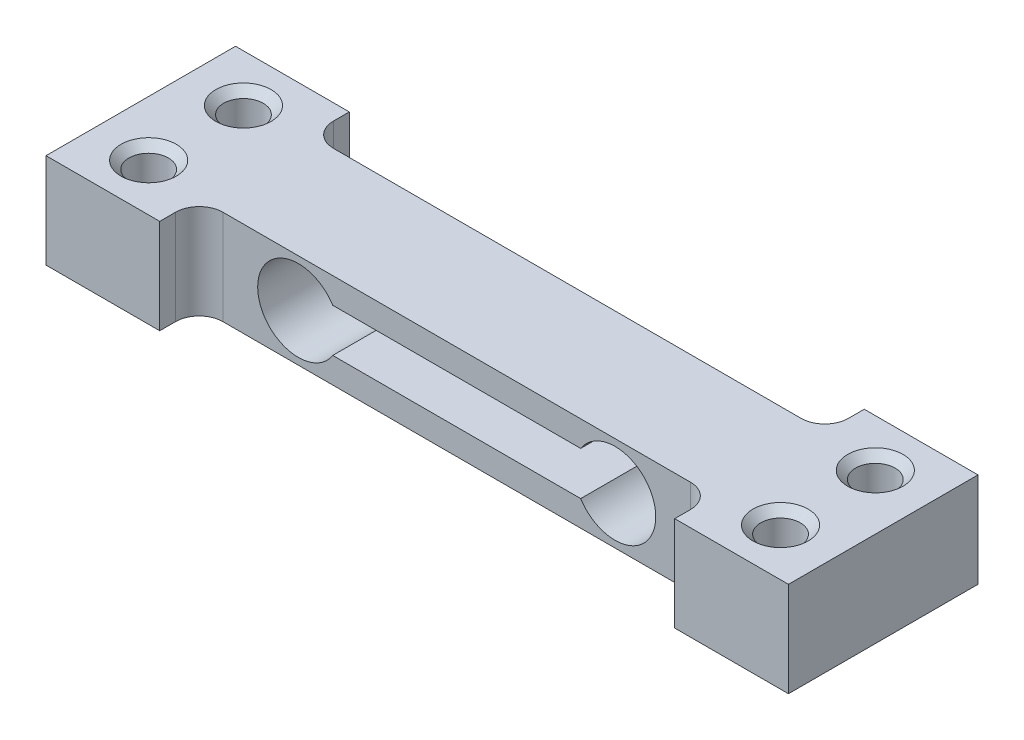
ISO-10303-21;
HEADER;
FILE_DESCRIPTION(('STEP AP214'),'2;1');
FILE_NAME('part.step','',(''),(''),'','','');
FILE_SCHEMA(('AUTOMOTIVE_DESIGN { 1 0 10303 214 1 1 1 1 }'));
ENDSEC;
DATA;
#1=APPLICATION_CONTEXT('core data for automotive mechanical design processes');
#2=APPLICATION_PROTOCOL_DEFINITION('international standard','automotive_design',2000,#1);
#3=PRODUCT_CONTEXT('',#1,'mechanical');
#4=PRODUCT('Part','Part','',(#3));
#5=PRODUCT_RELATED_PRODUCT_CATEGORY('part','',(#4));
#6=PRODUCT_DEFINITION_FORMATION('','',#4);
#7=PRODUCT_DEFINITION_CONTEXT('part definition',#1,'design');
#8=PRODUCT_DEFINITION('design','',#6,#7);
#9=PRODUCT_DEFINITION_SHAPE('','',#8);
#10=(LENGTH_UNIT() NAMED_UNIT(*) SI_UNIT(.MILLI.,.METRE.));
#11=(NAMED_UNIT(*) PLANE_ANGLE_UNIT() SI_UNIT($,.RADIAN.));
#12=(NAMED_UNIT(*) SI_UNIT($,.STERADIAN.) SOLID_ANGLE_UNIT());
#13=UNCERTAINTY_MEASURE_WITH_UNIT(LENGTH_MEASURE(1.E-05),#10,'distance_accuracy_value','');
#14=(GEOMETRIC_REPRESENTATION_CONTEXT(3) GLOBAL_UNCERTAINTY_ASSIGNED_CONTEXT((#13)) GLOBAL_UNIT_ASSIGNED_CONTEXT((#10,
#11,#12)) REPRESENTATION_CONTEXT('',''));
#15=CARTESIAN_POINT('',(0.,0.,0.));
#16=DIRECTION('',(0.,0.,1.));
#17=DIRECTION('',(1.,0.,0.));
#18=AXIS2_PLACEMENT_3D('',#15,#16,#17);
#19=CARTESIAN_POINT('',(0.,3.,-3.5));
#20=DIRECTION('',(0.,0.,1.));
#21=DIRECTION('',(1.,0.,0.));
#22=AXIS2_PLACEMENT_3D('',#19,#20,#21);
#23=PLANE('',#22);
#24=DIRECTION('',(1.,0.,0.));
#25=VECTOR('',#24,1.);
#26=CARTESIAN_POINT('',(0.,1.375,-3.5));
#27=LINE('',#26,#25);
#28=CARTESIAN_POINT('',(-7.84784589429227,1.375,-3.5));
#29=VERTEX_POINT('',#28);
#30=CARTESIAN_POINT('',(7.84784589429227,1.375,-3.5));
#31=VERTEX_POINT('',#30);
#32=EDGE_CURVE('E210',#29,#31,#27,.T.);
#33=ORIENTED_EDGE('',*,*,#32,.F.);
#34=CARTESIAN_POINT('',(-10.025,0.,-3.5));
#35=DIRECTION('',(0.,0.,-1.));
#36=DIRECTION('',(-1.,0.,0.));
#37=AXIS2_PLACEMENT_3D('',#34,#35,#36);
#38=CIRCLE('',#37,2.575);
#39=CARTESIAN_POINT('',(-7.84784589429227,-1.375,-3.5));
#40=VERTEX_POINT('',#39);
#41=EDGE_CURVE('E295',#40,#29,#38,.T.);
#42=ORIENTED_EDGE('',*,*,#41,.F.);
#43=DIRECTION('',(1.,0.,0.));
#44=VECTOR('',#43,1.);
#45=CARTESIAN_POINT('',(0.,-1.375,-3.5));
#46=LINE('',#45,#44);
#47=CARTESIAN_POINT('',(7.84784589429227,-1.375,-3.5));
#48=VERTEX_POINT('',#47);
#49=EDGE_CURVE('E207',#40,#48,#46,.T.);
#50=ORIENTED_EDGE('',*,*,#49,.T.);
#51=CARTESIAN_POINT('',(10.025,0.,-3.5));
#52=DIRECTION('',(0.,0.,1.));
#53=DIRECTION('',(1.,0.,0.));
#54=AXIS2_PLACEMENT_3D('',#51,#52,#53);
#55=CIRCLE('',#54,2.575);
#56=EDGE_CURVE('E150',#48,#31,#55,.T.);
#57=ORIENTED_EDGE('',*,*,#56,.T.);
#58=EDGE_LOOP('',(#33,#42,#50,#57));
#59=FACE_BOUND('',#58,.T.);
#60=DIRECTION('',(-1.,0.,0.));
#61=VECTOR('',#60,1.);
#62=CARTESIAN_POINT('',(0.,-3.,-3.5));
#63=LINE('',#62,#61);
#64=CARTESIAN_POINT('',(14.8,-3.,-3.5));
#65=VERTEX_POINT('',#64);
#66=CARTESIAN_POINT('',(-14.8,-3.,-3.5));
#67=VERTEX_POINT('',#66);
#68=EDGE_CURVE('E146',#65,#67,#63,.T.);
#69=ORIENTED_EDGE('',*,*,#68,.T.);
#70=DIRECTION('',(0.,-1.,0.));
#71=VECTOR('',#70,1.);
#72=CARTESIAN_POINT('',(-14.8,3.,-3.5));
#73=LINE('',#72,#71);
#74=CARTESIAN_POINT('',(-14.8,3.,-3.5));
#75=VERTEX_POINT('',#74);
#76=EDGE_CURVE('E269',#75,#67,#73,.T.);
#77=ORIENTED_EDGE('',*,*,#76,.F.);
#78=DIRECTION('',(-1.,0.,0.));
#79=VECTOR('',#78,1.);
#80=CARTESIAN_POINT('',(0.,3.,-3.5));
#81=LINE('',#80,#79);
#82=CARTESIAN_POINT('',(14.8,3.,-3.5));
#83=VERTEX_POINT('',#82);
#84=EDGE_CURVE('E164',#83,#75,#81,.T.);
#85=ORIENTED_EDGE('',*,*,#84,.F.);
#86=DIRECTION('',(0.,-1.,0.));
#87=VECTOR('',#86,1.);
#88=CARTESIAN_POINT('',(14.8,3.,-3.5));
#89=LINE('',#88,#87);
#90=EDGE_CURVE('E142',#83,#65,#89,.T.);
#91=ORIENTED_EDGE('',*,*,#90,.T.);
#92=EDGE_LOOP('',(#69,#77,#85,#91));
#93=FACE_BOUND('',#92,.T.);
#94=ADVANCED_FACE('F37',(#59,#93),#23,.F.);
#95=CARTESIAN_POINT('',(14.8,3.,3.5));
#96=DIRECTION('',(0.,0.,-1.));
#97=DIRECTION('',(-1.,0.,0.));
#98=AXIS2_PLACEMENT_3D('',#95,#96,#97);
#99=PLANE('',#98);
#100=CARTESIAN_POINT('',(-10.025,0.,3.5));
#101=DIRECTION('',(0.,0.,-1.));
#102=DIRECTION('',(-1.,0.,0.));
#103=AXIS2_PLACEMENT_3D('',#100,#101,#102);
#104=CIRCLE('',#103,2.575);
#105=CARTESIAN_POINT('',(-7.84784589429227,-1.375,3.5));
#106=VERTEX_POINT('',#105);
#107=CARTESIAN_POINT('',(-7.84784589429227,1.375,3.5));
#108=VERTEX_POINT('',#107);
#109=EDGE_CURVE('E321',#106,#108,#104,.T.);
#110=ORIENTED_EDGE('',*,*,#109,.T.);
#111=DIRECTION('',(1.,0.,0.));
#112=VECTOR('',#111,1.);
#113=CARTESIAN_POINT('',(0.,1.375,3.5));
#114=LINE('',#113,#112);
#115=CARTESIAN_POINT('',(7.84784589429227,1.375,3.5));
#116=VERTEX_POINT('',#115);
#117=EDGE_CURVE('E220',#108,#116,#114,.T.);
#118=ORIENTED_EDGE('',*,*,#117,.T.);
#119=CARTESIAN_POINT('',(10.025,0.,3.5));
#120=DIRECTION('',(0.,0.,1.));
#121=DIRECTION('',(1.,0.,0.));
#122=AXIS2_PLACEMENT_3D('',#119,#120,#121);
#123=CIRCLE('',#122,2.575);
#124=CARTESIAN_POINT('',(7.84784589429227,-1.375,3.5));
#125=VERTEX_POINT('',#124);
#126=EDGE_CURVE('E51',#125,#116,#123,.T.);
#127=ORIENTED_EDGE('',*,*,#126,.F.);
#128=DIRECTION('',(1.,0.,0.));
#129=VECTOR('',#128,1.);
#130=CARTESIAN_POINT('',(0.,-1.375,3.5));
#131=LINE('',#130,#129);
#132=EDGE_CURVE('E216',#106,#125,#131,.T.);
#133=ORIENTED_EDGE('',*,*,#132,.F.);
#134=EDGE_LOOP('',(#110,#118,#127,#133));
#135=FACE_BOUND('',#134,.T.);
#136=DIRECTION('',(1.,0.,0.));
#137=VECTOR('',#136,1.);
#138=CARTESIAN_POINT('',(14.8,3.,3.5));
#139=LINE('',#138,#137);
#140=CARTESIAN_POINT('',(-14.8,3.,3.5));
#141=VERTEX_POINT('',#140);
#142=CARTESIAN_POINT('',(14.8,3.,3.5));
#143=VERTEX_POINT('',#142);
#144=EDGE_CURVE('E101',#141,#143,#139,.T.);
#145=ORIENTED_EDGE('',*,*,#144,.F.);
#146=DIRECTION('',(0.,-1.,0.));
#147=VECTOR('',#146,1.);
#148=CARTESIAN_POINT('',(-14.8,3.,3.5));
#149=LINE('',#148,#147);
#150=CARTESIAN_POINT('',(-14.8,-3.,3.5));
#151=VERTEX_POINT('',#150);
#152=EDGE_CURVE('E248',#141,#151,#149,.T.);
#153=ORIENTED_EDGE('',*,*,#152,.T.);
#154=DIRECTION('',(1.,0.,0.));
#155=VECTOR('',#154,1.);
#156=CARTESIAN_POINT('',(14.8,-3.,3.5));
#157=LINE('',#156,#155);
#158=CARTESIAN_POINT('',(14.8,-3.,3.5));
#159=VERTEX_POINT('',#158);
#160=EDGE_CURVE('E149',#151,#159,#157,.T.);
#161=ORIENTED_EDGE('',*,*,#160,.T.);
#162=DIRECTION('',(0.,-1.,0.));
#163=VECTOR('',#162,1.);
#164=CARTESIAN_POINT('',(14.8,3.,3.5));
#165=LINE('',#164,#163);
#166=EDGE_CURVE('E11',#143,#159,#165,.T.);
#167=ORIENTED_EDGE('',*,*,#166,.F.);
#168=EDGE_LOOP('',(#145,#153,#161,#167));
#169=FACE_BOUND('',#168,.T.);
#170=ADVANCED_FACE('F391',(#135,#169),#99,.F.);
#171=CARTESIAN_POINT('',(14.8,3.,4.99999999999999));
#172=DIRECTION('',(0.,-1.,0.));
#173=DIRECTION('',(0.,0.,-1.));
#174=AXIS2_PLACEMENT_3D('',#171,#172,#173);
#175=CYLINDRICAL_SURFACE('',#174,1.5);
#176=CARTESIAN_POINT('',(14.8,-3.,4.99999999999999));
#177=DIRECTION('',(0.,-1.,0.));
#178=DIRECTION('',(0.,0.,1.));
#179=AXIS2_PLACEMENT_3D('',#176,#177,#178);
#180=CIRCLE('',#179,1.5);
#181=CARTESIAN_POINT('',(16.3,-3.,4.99999999999999));
#182=VERTEX_POINT('',#181);
#183=EDGE_CURVE('E152',#159,#182,#180,.T.);
#184=ORIENTED_EDGE('',*,*,#183,.T.);
#185=DIRECTION('',(0.,-1.,0.));
#186=VECTOR('',#185,1.);
#187=CARTESIAN_POINT('',(16.3,3.,4.99999999999999));
#188=LINE('',#187,#186);
#189=CARTESIAN_POINT('',(16.3,3.,4.99999999999999));
#190=VERTEX_POINT('',#189);
#191=EDGE_CURVE('E44',#190,#182,#188,.T.);
#192=ORIENTED_EDGE('',*,*,#191,.F.);
#193=CARTESIAN_POINT('',(14.8,3.,4.99999999999999));
#194=DIRECTION('',(0.,-1.,0.));
#195=DIRECTION('',(0.,0.,1.));
#196=AXIS2_PLACEMENT_3D('',#193,#194,#195);
#197=CIRCLE('',#196,1.5);
#198=EDGE_CURVE('E201',#143,#190,#197,.T.);
#199=ORIENTED_EDGE('',*,*,#198,.F.);
#200=ORIENTED_EDGE('',*,*,#166,.T.);
#201=EDGE_LOOP('',(#184,#192,#199,#200));
#202=FACE_BOUND('',#201,.T.);
#203=ADVANCED_FACE('F396',(#202),#175,.F.);
#204=CARTESIAN_POINT('',(16.3,3.,4.99999999999999));
#205=DIRECTION('',(1.,0.,0.));
#206=DIRECTION('',(0.,0.,-1.));
#207=AXIS2_PLACEMENT_3D('',#204,#205,#206);
#208=PLANE('',#207);
#209=DIRECTION('',(0.,0.,1.));
#210=VECTOR('',#209,1.);
#211=CARTESIAN_POINT('',(16.3,-3.,4.99999999999999));
#212=LINE('',#211,#210);
#213=CARTESIAN_POINT('',(16.3,-3.,6.));
#214=VERTEX_POINT('',#213);
#215=EDGE_CURVE('E154',#182,#214,#212,.T.);
#216=ORIENTED_EDGE('',*,*,#215,.T.);
#217=DIRECTION('',(0.,-1.,0.));
#218=VECTOR('',#217,1.);
#219=CARTESIAN_POINT('',(16.3,3.,6.));
#220=LINE('',#219,#218);
#221=CARTESIAN_POINT('',(16.3,3.,6.));
#222=VERTEX_POINT('',#221);
#223=EDGE_CURVE('E171',#222,#214,#220,.T.);
#224=ORIENTED_EDGE('',*,*,#223,.F.);
#225=DIRECTION('',(0.,0.,1.));
#226=VECTOR('',#225,1.);
#227=CARTESIAN_POINT('',(16.3,3.,4.99999999999999));
#228=LINE('',#227,#226);
#229=EDGE_CURVE('E180',#190,#222,#228,.T.);
#230=ORIENTED_EDGE('',*,*,#229,.F.);
#231=ORIENTED_EDGE('',*,*,#191,.T.);
#232=EDGE_LOOP('',(#216,#224,#230,#231));
#233=FACE_BOUND('',#232,.T.);
#234=ADVANCED_FACE('F178',(#233),#208,.F.);
#235=CARTESIAN_POINT('',(23.5,3.,6.));
#236=DIRECTION('',(0.,0.,-1.));
#237=DIRECTION('',(-1.,0.,0.));
#238=AXIS2_PLACEMENT_3D('',#235,#236,#237);
#239=PLANE('',#238);
#240=DIRECTION('',(1.,0.,0.));
#241=VECTOR('',#240,1.);
#242=CARTESIAN_POINT('',(23.5,-3.,6.));
#243=LINE('',#242,#241);
#244=CARTESIAN_POINT('',(23.5,-3.,6.));
#245=VERTEX_POINT('',#244);
#246=EDGE_CURVE('E156',#214,#245,#243,.T.);
#247=ORIENTED_EDGE('',*,*,#246,.T.);
#248=DIRECTION('',(0.,-1.,0.));
#249=VECTOR('',#248,1.);
#250=CARTESIAN_POINT('',(23.5,3.,6.));
#251=LINE('',#250,#249);
#252=CARTESIAN_POINT('',(23.5,3.,6.));
#253=VERTEX_POINT('',#252);
#254=EDGE_CURVE('E168',#253,#245,#251,.T.);
#255=ORIENTED_EDGE('',*,*,#254,.F.);
#256=DIRECTION('',(1.,0.,0.));
#257=VECTOR('',#256,1.);
#258=CARTESIAN_POINT('',(23.5,3.,6.));
#259=LINE('',#258,#257);
#260=EDGE_CURVE('E197',#222,#253,#259,.T.);
#261=ORIENTED_EDGE('',*,*,#260,.F.);
#262=ORIENTED_EDGE('',*,*,#223,.T.);
#263=EDGE_LOOP('',(#247,#255,#261,#262));
#264=FACE_BOUND('',#263,.T.);
#265=ADVANCED_FACE('F193',(#264),#239,.F.);
#266=CARTESIAN_POINT('',(23.5,3.,-6.));
#267=DIRECTION('',(-1.,0.,0.));
#268=DIRECTION('',(0.,0.,1.));
#269=AXIS2_PLACEMENT_3D('',#266,#267,#268);
#270=PLANE('',#269);
#271=DIRECTION('',(0.,0.,-1.));
#272=VECTOR('',#271,1.);
#273=CARTESIAN_POINT('',(23.5,-3.,-6.));
#274=LINE('',#273,#272);
#275=CARTESIAN_POINT('',(23.5,-3.,-6.));
#276=VERTEX_POINT('',#275);
#277=EDGE_CURVE('E158',#245,#276,#274,.T.);
#278=ORIENTED_EDGE('',*,*,#277,.T.);
#279=DIRECTION('',(0.,-1.,0.));
#280=VECTOR('',#279,1.);
#281=CARTESIAN_POINT('',(23.5,3.,-6.));
#282=LINE('',#281,#280);
#283=CARTESIAN_POINT('',(23.5,3.,-6.));
#284=VERTEX_POINT('',#283);
#285=EDGE_CURVE('E137',#284,#276,#282,.T.);
#286=ORIENTED_EDGE('',*,*,#285,.F.);
#287=DIRECTION('',(0.,0.,-1.));
#288=VECTOR('',#287,1.);
#289=CARTESIAN_POINT('',(23.5,3.,-6.));
#290=LINE('',#289,#288);
#291=EDGE_CURVE('E125',#253,#284,#290,.T.);
#292=ORIENTED_EDGE('',*,*,#291,.F.);
#293=ORIENTED_EDGE('',*,*,#254,.T.);
#294=EDGE_LOOP('',(#278,#286,#292,#293));
#295=FACE_BOUND('',#294,.T.);
#296=ADVANCED_FACE('F196',(#295),#270,.F.);
#297=CARTESIAN_POINT('',(16.3,3.,-6.));
#298=DIRECTION('',(0.,0.,1.));
#299=DIRECTION('',(1.,0.,0.));
#300=AXIS2_PLACEMENT_3D('',#297,#298,#299);
#301=PLANE('',#300);
#302=DIRECTION('',(-1.,0.,0.));
#303=VECTOR('',#302,1.);
#304=CARTESIAN_POINT('',(16.3,-3.,-6.));
#305=LINE('',#304,#303);
#306=CARTESIAN_POINT('',(16.3,-3.,-6.));
#307=VERTEX_POINT('',#306);
#308=EDGE_CURVE('E134',#276,#307,#305,.T.);
#309=ORIENTED_EDGE('',*,*,#308,.T.);
#310=DIRECTION('',(0.,-1.,0.));
#311=VECTOR('',#310,1.);
#312=CARTESIAN_POINT('',(16.3,3.,-6.));
#313=LINE('',#312,#311);
#314=CARTESIAN_POINT('',(16.3,3.,-6.));
#315=VERTEX_POINT('',#314);
#316=EDGE_CURVE('E131',#315,#307,#313,.T.);
#317=ORIENTED_EDGE('',*,*,#316,.F.);
#318=DIRECTION('',(-1.,0.,0.));
#319=VECTOR('',#318,1.);
#320=CARTESIAN_POINT('',(16.3,3.,-6.));
#321=LINE('',#320,#319);
#322=EDGE_CURVE('E117',#284,#315,#321,.T.);
#323=ORIENTED_EDGE('',*,*,#322,.F.);
#324=ORIENTED_EDGE('',*,*,#285,.T.);
#325=EDGE_LOOP('',(#309,#317,#323,#324));
#326=FACE_BOUND('',#325,.T.);
#327=ADVANCED_FACE('F132',(#326),#301,.F.);
#328=CARTESIAN_POINT('',(16.3,3.,-5.));
#329=DIRECTION('',(1.,0.,0.));
#330=DIRECTION('',(0.,0.,-1.));
#331=AXIS2_PLACEMENT_3D('',#328,#329,#330);
#332=PLANE('',#331);
#333=DIRECTION('',(0.,0.,1.));
#334=VECTOR('',#333,1.);
#335=CARTESIAN_POINT('',(16.3,-3.,-5.));
#336=LINE('',#335,#334);
#337=CARTESIAN_POINT('',(16.3,-3.,-5.));
#338=VERTEX_POINT('',#337);
#339=EDGE_CURVE('E161',#307,#338,#336,.T.);
#340=ORIENTED_EDGE('',*,*,#339,.T.);
#341=DIRECTION('',(0.,-1.,0.));
#342=VECTOR('',#341,1.);
#343=CARTESIAN_POINT('',(16.3,3.,-5.));
#344=LINE('',#343,#342);
#345=CARTESIAN_POINT('',(16.3,3.,-5.));
#346=VERTEX_POINT('',#345);
#347=EDGE_CURVE('E138',#346,#338,#344,.T.);
#348=ORIENTED_EDGE('',*,*,#347,.F.);
#349=DIRECTION('',(0.,0.,1.));
#350=VECTOR('',#349,1.);
#351=CARTESIAN_POINT('',(16.3,3.,-5.));
#352=LINE('',#351,#350);
#353=EDGE_CURVE('E122',#315,#346,#352,.T.);
#354=ORIENTED_EDGE('',*,*,#353,.F.);
#355=ORIENTED_EDGE('',*,*,#316,.T.);
#356=EDGE_LOOP('',(#340,#348,#354,#355));
#357=FACE_BOUND('',#356,.T.);
#358=ADVANCED_FACE('F140',(#357),#332,.F.);
#359=CARTESIAN_POINT('',(14.8,3.,-5.));
#360=DIRECTION('',(0.,-1.,0.));
#361=DIRECTION('',(0.,0.,-1.));
#362=AXIS2_PLACEMENT_3D('',#359,#360,#361);
#363=CYLINDRICAL_SURFACE('',#362,1.5);
#364=CARTESIAN_POINT('',(14.8,-3.,-5.));
#365=DIRECTION('',(0.,-1.,0.));
#366=DIRECTION('',(0.,0.,1.));
#367=AXIS2_PLACEMENT_3D('',#364,#365,#366);
#368=CIRCLE('',#367,1.5);
#369=EDGE_CURVE('E93',#338,#65,#368,.T.);
#370=ORIENTED_EDGE('',*,*,#369,.T.);
#371=ORIENTED_EDGE('',*,*,#90,.F.);
#372=CARTESIAN_POINT('',(14.8,3.,-5.));
#373=DIRECTION('',(0.,-1.,0.));
#374=DIRECTION('',(0.,0.,1.));
#375=AXIS2_PLACEMENT_3D('',#372,#373,#374);
#376=CIRCLE('',#375,1.5);
#377=EDGE_CURVE('E60',#346,#83,#376,.T.);
#378=ORIENTED_EDGE('',*,*,#377,.F.);
#379=ORIENTED_EDGE('',*,*,#347,.T.);
#380=EDGE_LOOP('',(#370,#371,#378,#379));
#381=FACE_BOUND('',#380,.T.);
#382=ADVANCED_FACE('F380',(#381),#363,.F.);
#383=CARTESIAN_POINT('',(14.8,3.,-5.));
#384=DIRECTION('',(0.,1.,0.));
#385=DIRECTION('',(0.,0.,1.));
#386=AXIS2_PLACEMENT_3D('',#383,#384,#385);
#387=PLANE('',#386);
#388=CARTESIAN_POINT('',(20.,3.,-3.));
#389=DIRECTION('',(0.,1.,0.));
#390=DIRECTION('',(0.,0.,1.));
#391=AXIS2_PLACEMENT_3D('',#388,#389,#390);
#392=CIRCLE('',#391,1.75);
#393=CARTESIAN_POINT('',(20.,3.,-1.25));
#394=VERTEX_POINT('',#393);
#395=EDGE_CURVE('E242',#394,#394,#392,.T.);
#396=ORIENTED_EDGE('',*,*,#395,.F.);
#397=EDGE_LOOP('',(#396));
#398=FACE_BOUND('',#397,.T.);
#399=CARTESIAN_POINT('',(20.,3.,3.));
#400=DIRECTION('',(0.,1.,0.));
#401=DIRECTION('',(0.,0.,1.));
#402=AXIS2_PLACEMENT_3D('',#399,#400,#401);
#403=CIRCLE('',#402,1.75);
#404=CARTESIAN_POINT('',(20.,3.,4.75));
#405=VERTEX_POINT('',#404);
#406=EDGE_CURVE('E230',#405,#405,#403,.T.);
#407=ORIENTED_EDGE('',*,*,#406,.F.);
#408=EDGE_LOOP('',(#407));
#409=FACE_BOUND('',#408,.T.);
#410=ORIENTED_EDGE('',*,*,#84,.T.);
#411=CARTESIAN_POINT('',(-14.8,3.,-5.));
#412=DIRECTION('',(0.,1.,0.));
#413=DIRECTION('',(0.,0.,1.));
#414=AXIS2_PLACEMENT_3D('',#411,#412,#413);
#415=CIRCLE('',#414,1.5);
#416=CARTESIAN_POINT('',(-16.3,3.,-5.));
#417=VERTEX_POINT('',#416);
#418=EDGE_CURVE('E272',#417,#75,#415,.T.);
#419=ORIENTED_EDGE('',*,*,#418,.F.);
#420=DIRECTION('',(0.,0.,1.));
#421=VECTOR('',#420,1.);
#422=CARTESIAN_POINT('',(-16.3,3.,-5.));
#423=LINE('',#422,#421);
#424=CARTESIAN_POINT('',(-16.3,3.,-6.));
#425=VERTEX_POINT('',#424);
#426=EDGE_CURVE('E298',#425,#417,#423,.T.);
#427=ORIENTED_EDGE('',*,*,#426,.F.);
#428=DIRECTION('',(1.,0.,0.));
#429=VECTOR('',#428,1.);
#430=CARTESIAN_POINT('',(-16.3,3.,-6.));
#431=LINE('',#430,#429);
#432=CARTESIAN_POINT('',(-23.5,3.,-6.));
#433=VERTEX_POINT('',#432);
#434=EDGE_CURVE('E301',#433,#425,#431,.T.);
#435=ORIENTED_EDGE('',*,*,#434,.F.);
#436=DIRECTION('',(0.,0.,-1.));
#437=VECTOR('',#436,1.);
#438=CARTESIAN_POINT('',(-23.5,3.,-6.));
#439=LINE('',#438,#437);
#440=CARTESIAN_POINT('',(-23.5,3.,6.));
#441=VERTEX_POINT('',#440);
#442=EDGE_CURVE('E304',#441,#433,#439,.T.);
#443=ORIENTED_EDGE('',*,*,#442,.F.);
#444=DIRECTION('',(-1.,0.,0.));
#445=VECTOR('',#444,1.);
#446=CARTESIAN_POINT('',(-23.5,3.,6.));
#447=LINE('',#446,#445);
#448=CARTESIAN_POINT('',(-16.3,3.,6.));
#449=VERTEX_POINT('',#448);
#450=EDGE_CURVE('E307',#449,#441,#447,.T.);
#451=ORIENTED_EDGE('',*,*,#450,.F.);
#452=DIRECTION('',(0.,0.,1.));
#453=VECTOR('',#452,1.);
#454=CARTESIAN_POINT('',(-16.3,3.,4.99999999999999));
#455=LINE('',#454,#453);
#456=CARTESIAN_POINT('',(-16.3,3.,4.99999999999999));
#457=VERTEX_POINT('',#456);
#458=EDGE_CURVE('E310',#457,#449,#455,.T.);
#459=ORIENTED_EDGE('',*,*,#458,.F.);
#460=CARTESIAN_POINT('',(-14.8,3.,4.99999999999999));
#461=DIRECTION('',(0.,1.,0.));
#462=DIRECTION('',(0.,0.,1.));
#463=AXIS2_PLACEMENT_3D('',#460,#461,#462);
#464=CIRCLE('',#463,1.5);
#465=EDGE_CURVE('E276',#141,#457,#464,.T.);
#466=ORIENTED_EDGE('',*,*,#465,.F.);
#467=ORIENTED_EDGE('',*,*,#144,.T.);
#468=ORIENTED_EDGE('',*,*,#198,.T.);
#469=ORIENTED_EDGE('',*,*,#229,.T.);
#470=ORIENTED_EDGE('',*,*,#260,.T.);
#471=ORIENTED_EDGE('',*,*,#291,.T.);
#472=ORIENTED_EDGE('',*,*,#322,.T.);
#473=ORIENTED_EDGE('',*,*,#353,.T.);
#474=ORIENTED_EDGE('',*,*,#377,.T.);
#475=EDGE_LOOP('',(#410,#419,#427,#435,#443,#451,#459,#466,#467,#468,#469,#470,#471,#472,#473,#474));
#476=FACE_BOUND('',#475,.T.);
#477=CARTESIAN_POINT('',(-20.,3.,-3.));
#478=DIRECTION('',(0.,-1.,0.));
#479=DIRECTION('',(0.,0.,1.));
#480=AXIS2_PLACEMENT_3D('',#477,#478,#479);
#481=CIRCLE('',#480,1.75);
#482=CARTESIAN_POINT('',(-20.,3.,-1.25));
#483=VERTEX_POINT('',#482);
#484=EDGE_CURVE('E344',#483,#483,#481,.T.);
#485=ORIENTED_EDGE('',*,*,#484,.T.);
#486=EDGE_LOOP('',(#485));
#487=FACE_BOUND('',#486,.T.);
#488=CARTESIAN_POINT('',(-20.,3.,3.));
#489=DIRECTION('',(0.,-1.,0.));
#490=DIRECTION('',(0.,0.,1.));
#491=AXIS2_PLACEMENT_3D('',#488,#489,#490);
#492=CIRCLE('',#491,1.75);
#493=CARTESIAN_POINT('',(-20.,3.,4.75));
#494=VERTEX_POINT('',#493);
#495=EDGE_CURVE('E332',#494,#494,#492,.T.);
#496=ORIENTED_EDGE('',*,*,#495,.T.);
#497=EDGE_LOOP('',(#496));
#498=FACE_BOUND('',#497,.T.);
#499=ADVANCED_FACE('F119',(#398,#409,#476,#487,#498),#387,.T.);
#500=CARTESIAN_POINT('',(14.8,-3.,-5.));
#501=DIRECTION('',(0.,1.,0.));
#502=DIRECTION('',(0.,0.,1.));
#503=AXIS2_PLACEMENT_3D('',#500,#501,#502);
#504=PLANE('',#503);
#505=CARTESIAN_POINT('',(20.,-3.,-3.));
#506=DIRECTION('',(0.,1.,0.));
#507=DIRECTION('',(0.,0.,1.));
#508=AXIS2_PLACEMENT_3D('',#505,#506,#507);
#509=CIRCLE('',#508,1.75);
#510=CARTESIAN_POINT('',(20.,-3.,-1.25));
#511=VERTEX_POINT('',#510);
#512=EDGE_CURVE('E245',#511,#511,#509,.T.);
#513=ORIENTED_EDGE('',*,*,#512,.T.);
#514=EDGE_LOOP('',(#513));
#515=FACE_BOUND('',#514,.T.);
#516=CARTESIAN_POINT('',(20.,-3.,3.));
#517=DIRECTION('',(0.,1.,0.));
#518=DIRECTION('',(0.,0.,1.));
#519=AXIS2_PLACEMENT_3D('',#516,#517,#518);
#520=CIRCLE('',#519,1.75);
#521=CARTESIAN_POINT('',(20.,-3.,4.75));
#522=VERTEX_POINT('',#521);
#523=EDGE_CURVE('E233',#522,#522,#520,.T.);
#524=ORIENTED_EDGE('',*,*,#523,.T.);
#525=EDGE_LOOP('',(#524));
#526=FACE_BOUND('',#525,.T.);
#527=ORIENTED_EDGE('',*,*,#68,.F.);
#528=ORIENTED_EDGE('',*,*,#369,.F.);
#529=ORIENTED_EDGE('',*,*,#339,.F.);
#530=ORIENTED_EDGE('',*,*,#308,.F.);
#531=ORIENTED_EDGE('',*,*,#277,.F.);
#532=ORIENTED_EDGE('',*,*,#246,.F.);
#533=ORIENTED_EDGE('',*,*,#215,.F.);
#534=ORIENTED_EDGE('',*,*,#183,.F.);
#535=ORIENTED_EDGE('',*,*,#160,.F.);
#536=CARTESIAN_POINT('',(-14.8,-3.,4.99999999999999));
#537=DIRECTION('',(0.,1.,0.));
#538=DIRECTION('',(0.,0.,1.));
#539=AXIS2_PLACEMENT_3D('',#536,#537,#538);
#540=CIRCLE('',#539,1.5);
#541=CARTESIAN_POINT('',(-16.3,-3.,4.99999999999999));
#542=VERTEX_POINT('',#541);
#543=EDGE_CURVE('E292',#151,#542,#540,.T.);
#544=ORIENTED_EDGE('',*,*,#543,.T.);
#545=DIRECTION('',(0.,0.,1.));
#546=VECTOR('',#545,1.);
#547=CARTESIAN_POINT('',(-16.3,-3.,4.99999999999999));
#548=LINE('',#547,#546);
#549=CARTESIAN_POINT('',(-16.3,-3.,6.));
#550=VERTEX_POINT('',#549);
#551=EDGE_CURVE('E289',#542,#550,#548,.T.);
#552=ORIENTED_EDGE('',*,*,#551,.T.);
#553=DIRECTION('',(-1.,0.,0.));
#554=VECTOR('',#553,1.);
#555=CARTESIAN_POINT('',(-23.5,-3.,6.));
#556=LINE('',#555,#554);
#557=CARTESIAN_POINT('',(-23.5,-3.,6.));
#558=VERTEX_POINT('',#557);
#559=EDGE_CURVE('E286',#550,#558,#556,.T.);
#560=ORIENTED_EDGE('',*,*,#559,.T.);
#561=DIRECTION('',(0.,0.,-1.));
#562=VECTOR('',#561,1.);
#563=CARTESIAN_POINT('',(-23.5,-3.,-6.));
#564=LINE('',#563,#562);
#565=CARTESIAN_POINT('',(-23.5,-3.,-6.));
#566=VERTEX_POINT('',#565);
#567=EDGE_CURVE('E283',#558,#566,#564,.T.);
#568=ORIENTED_EDGE('',*,*,#567,.T.);
#569=DIRECTION('',(1.,0.,0.));
#570=VECTOR('',#569,1.);
#571=CARTESIAN_POINT('',(-16.3,-3.,-6.));
#572=LINE('',#571,#570);
#573=CARTESIAN_POINT('',(-16.3,-3.,-6.));
#574=VERTEX_POINT('',#573);
#575=EDGE_CURVE('E280',#566,#574,#572,.T.);
#576=ORIENTED_EDGE('',*,*,#575,.T.);
#577=DIRECTION('',(0.,0.,1.));
#578=VECTOR('',#577,1.);
#579=CARTESIAN_POINT('',(-16.3,-3.,-5.));
#580=LINE('',#579,#578);
#581=CARTESIAN_POINT('',(-16.3,-3.,-5.));
#582=VERTEX_POINT('',#581);
#583=EDGE_CURVE('E277',#574,#582,#580,.T.);
#584=ORIENTED_EDGE('',*,*,#583,.T.);
#585=CARTESIAN_POINT('',(-14.8,-3.,-5.));
#586=DIRECTION('',(0.,1.,0.));
#587=DIRECTION('',(0.,0.,1.));
#588=AXIS2_PLACEMENT_3D('',#585,#586,#587);
#589=CIRCLE('',#588,1.5);
#590=EDGE_CURVE('E273',#582,#67,#589,.T.);
#591=ORIENTED_EDGE('',*,*,#590,.T.);
#592=EDGE_LOOP('',(#527,#528,#529,#530,#531,#532,#533,#534,#535,#544,#552,#560,#568,#576,#584,#591));
#593=FACE_BOUND('',#592,.T.);
#594=CARTESIAN_POINT('',(-20.,-3.,-3.));
#595=DIRECTION('',(0.,-1.,0.));
#596=DIRECTION('',(0.,0.,1.));
#597=AXIS2_PLACEMENT_3D('',#594,#595,#596);
#598=CIRCLE('',#597,1.75);
#599=CARTESIAN_POINT('',(-20.,-3.,-1.25));
#600=VERTEX_POINT('',#599);
#601=EDGE_CURVE('E347',#600,#600,#598,.T.);
#602=ORIENTED_EDGE('',*,*,#601,.F.);
#603=EDGE_LOOP('',(#602));
#604=FACE_BOUND('',#603,.T.);
#605=CARTESIAN_POINT('',(-20.,-3.,3.));
#606=DIRECTION('',(0.,-1.,0.));
#607=DIRECTION('',(0.,0.,1.));
#608=AXIS2_PLACEMENT_3D('',#605,#606,#607);
#609=CIRCLE('',#608,1.75);
#610=CARTESIAN_POINT('',(-20.,-3.,4.75));
#611=VERTEX_POINT('',#610);
#612=EDGE_CURVE('E335',#611,#611,#609,.T.);
#613=ORIENTED_EDGE('',*,*,#612,.F.);
#614=EDGE_LOOP('',(#613));
#615=FACE_BOUND('',#614,.T.);
#616=ADVANCED_FACE('F187',(#515,#526,#593,#604,#615),#504,.F.);
#617=CARTESIAN_POINT('',(10.025,0.,-6.));
#618=DIRECTION('',(0.,0.,1.));
#619=DIRECTION('',(1.,0.,0.));
#620=AXIS2_PLACEMENT_3D('',#617,#618,#619);
#621=CYLINDRICAL_SURFACE('',#620,2.575);
#622=DIRECTION('',(0.,0.,1.));
#623=VECTOR('',#622,1.);
#624=CARTESIAN_POINT('',(7.84784589429227,-1.375,-6.));
#625=LINE('',#624,#623);
#626=EDGE_CURVE('E213',#48,#125,#625,.T.);
#627=ORIENTED_EDGE('',*,*,#626,.T.);
#628=ORIENTED_EDGE('',*,*,#126,.T.);
#629=DIRECTION('',(0.,0.,1.));
#630=VECTOR('',#629,1.);
#631=CARTESIAN_POINT('',(7.84784589429227,1.375,-6.));
#632=LINE('',#631,#630);
#633=EDGE_CURVE('E214',#31,#116,#632,.T.);
#634=ORIENTED_EDGE('',*,*,#633,.F.);
#635=ORIENTED_EDGE('',*,*,#56,.F.);
#636=EDGE_LOOP('',(#627,#628,#634,#635));
#637=FACE_BOUND('',#636,.T.);
#638=ADVANCED_FACE('F355',(#637),#621,.F.);
#639=CARTESIAN_POINT('',(0.,-1.375,-6.));
#640=DIRECTION('',(0.,-1.,0.));
#641=DIRECTION('',(0.,0.,-1.));
#642=AXIS2_PLACEMENT_3D('',#639,#640,#641);
#643=PLANE('',#642);
#644=ORIENTED_EDGE('',*,*,#49,.F.);
#645=DIRECTION('',(0.,0.,1.));
#646=VECTOR('',#645,1.);
#647=CARTESIAN_POINT('',(-7.84784589429227,-1.375,-6.));
#648=LINE('',#647,#646);
#649=EDGE_CURVE('E317',#40,#106,#648,.T.);
#650=ORIENTED_EDGE('',*,*,#649,.T.);
#651=ORIENTED_EDGE('',*,*,#132,.T.);
#652=ORIENTED_EDGE('',*,*,#626,.F.);
#653=EDGE_LOOP('',(#644,#650,#651,#652));
#654=FACE_BOUND('',#653,.T.);
#655=ADVANCED_FACE('F455',(#654),#643,.F.);
#656=CARTESIAN_POINT('',(0.,1.375,-6.));
#657=DIRECTION('',(0.,-1.,0.));
#658=DIRECTION('',(0.,0.,-1.));
#659=AXIS2_PLACEMENT_3D('',#656,#657,#658);
#660=PLANE('',#659);
#661=ORIENTED_EDGE('',*,*,#32,.T.);
#662=ORIENTED_EDGE('',*,*,#633,.T.);
#663=ORIENTED_EDGE('',*,*,#117,.F.);
#664=DIRECTION('',(0.,0.,1.));
#665=VECTOR('',#664,1.);
#666=CARTESIAN_POINT('',(-7.84784589429227,1.375,-6.));
#667=LINE('',#666,#665);
#668=EDGE_CURVE('E318',#29,#108,#667,.T.);
#669=ORIENTED_EDGE('',*,*,#668,.F.);
#670=EDGE_LOOP('',(#661,#662,#663,#669));
#671=FACE_BOUND('',#670,.T.);
#672=ADVANCED_FACE('F537',(#671),#660,.T.);
#673=CARTESIAN_POINT('',(20.,-2.5,3.));
#674=DIRECTION('',(0.,-1.,0.));
#675=DIRECTION('',(0.,0.,-1.));
#676=AXIS2_PLACEMENT_3D('',#673,#674,#675);
#677=CONICAL_SURFACE('',#676,1.25,0.785398163397448);
#678=ORIENTED_EDGE('',*,*,#523,.F.);
#679=EDGE_LOOP('',(#678));
#680=FACE_BOUND('',#679,.T.);
#681=CARTESIAN_POINT('',(20.,-2.5,3.));
#682=DIRECTION('',(0.,1.,0.));
#683=DIRECTION('',(0.,0.,1.));
#684=AXIS2_PLACEMENT_3D('',#681,#682,#683);
#685=CIRCLE('',#684,1.25);
#686=CARTESIAN_POINT('',(20.,-2.5,4.25));
#687=VERTEX_POINT('',#686);
#688=EDGE_CURVE('E224',#687,#687,#685,.T.);
#689=ORIENTED_EDGE('',*,*,#688,.T.);
#690=EDGE_LOOP('',(#689));
#691=FACE_BOUND('',#690,.T.);
#692=ADVANCED_FACE('F543',(#680,#691),#677,.F.);
#693=CARTESIAN_POINT('',(20.,3.,3.));
#694=DIRECTION('',(0.,1.,0.));
#695=DIRECTION('',(0.,0.,1.));
#696=AXIS2_PLACEMENT_3D('',#693,#694,#695);
#697=CYLINDRICAL_SURFACE('',#696,1.25);
#698=ORIENTED_EDGE('',*,*,#688,.F.);
#699=EDGE_LOOP('',(#698));
#700=FACE_BOUND('',#699,.T.);
#701=CARTESIAN_POINT('',(20.,2.5,3.));
#702=DIRECTION('',(0.,1.,0.));
#703=DIRECTION('',(0.,0.,1.));
#704=AXIS2_PLACEMENT_3D('',#701,#702,#703);
#705=CIRCLE('',#704,1.25);
#706=CARTESIAN_POINT('',(20.,2.5,4.25));
#707=VERTEX_POINT('',#706);
#708=EDGE_CURVE('E227',#707,#707,#705,.T.);
#709=ORIENTED_EDGE('',*,*,#708,.T.);
#710=EDGE_LOOP('',(#709));
#711=FACE_BOUND('',#710,.T.);
#712=ADVANCED_FACE('F560',(#700,#711),#697,.F.);
#713=CARTESIAN_POINT('',(20.,3.,3.));
#714=DIRECTION('',(0.,1.,0.));
#715=DIRECTION('',(0.,0.,1.));
#716=AXIS2_PLACEMENT_3D('',#713,#714,#715);
#717=CONICAL_SURFACE('',#716,1.75,0.785398163397447);
#718=ORIENTED_EDGE('',*,*,#708,.F.);
#719=EDGE_LOOP('',(#718));
#720=FACE_BOUND('',#719,.T.);
#721=ORIENTED_EDGE('',*,*,#406,.T.);
#722=EDGE_LOOP('',(#721));
#723=FACE_BOUND('',#722,.T.);
#724=ADVANCED_FACE('F723',(#720,#723),#717,.F.);
#725=CARTESIAN_POINT('',(20.,-2.5,-3.));
#726=DIRECTION('',(0.,-1.,0.));
#727=DIRECTION('',(0.,0.,-1.));
#728=AXIS2_PLACEMENT_3D('',#725,#726,#727);
#729=CONICAL_SURFACE('',#728,1.25,0.785398163397448);
#730=ORIENTED_EDGE('',*,*,#512,.F.);
#731=EDGE_LOOP('',(#730));
#732=FACE_BOUND('',#731,.T.);
#733=CARTESIAN_POINT('',(20.,-2.5,-3.));
#734=DIRECTION('',(0.,1.,0.));
#735=DIRECTION('',(0.,0.,1.));
#736=AXIS2_PLACEMENT_3D('',#733,#734,#735);
#737=CIRCLE('',#736,1.25);
#738=CARTESIAN_POINT('',(20.,-2.5,-1.75));
#739=VERTEX_POINT('',#738);
#740=EDGE_CURVE('E236',#739,#739,#737,.T.);
#741=ORIENTED_EDGE('',*,*,#740,.T.);
#742=EDGE_LOOP('',(#741));
#743=FACE_BOUND('',#742,.T.);
#744=ADVANCED_FACE('F719',(#732,#743),#729,.F.);
#745=CARTESIAN_POINT('',(20.,3.,-3.));
#746=DIRECTION('',(0.,1.,0.));
#747=DIRECTION('',(0.,0.,1.));
#748=AXIS2_PLACEMENT_3D('',#745,#746,#747);
#749=CYLINDRICAL_SURFACE('',#748,1.25);
#750=ORIENTED_EDGE('',*,*,#740,.F.);
#751=EDGE_LOOP('',(#750));
#752=FACE_BOUND('',#751,.T.);
#753=CARTESIAN_POINT('',(20.,2.5,-3.));
#754=DIRECTION('',(0.,1.,0.));
#755=DIRECTION('',(0.,0.,1.));
#756=AXIS2_PLACEMENT_3D('',#753,#754,#755);
#757=CIRCLE('',#756,1.25);
#758=CARTESIAN_POINT('',(20.,2.5,-1.75));
#759=VERTEX_POINT('',#758);
#760=EDGE_CURVE('E239',#759,#759,#757,.T.);
#761=ORIENTED_EDGE('',*,*,#760,.T.);
#762=EDGE_LOOP('',(#761));
#763=FACE_BOUND('',#762,.T.);
#764=ADVANCED_FACE('F715',(#752,#763),#749,.F.);
#765=CARTESIAN_POINT('',(20.,3.,-3.));
#766=DIRECTION('',(0.,1.,0.));
#767=DIRECTION('',(0.,0.,1.));
#768=AXIS2_PLACEMENT_3D('',#765,#766,#767);
#769=CONICAL_SURFACE('',#768,1.75,0.785398163397443);
#770=ORIENTED_EDGE('',*,*,#760,.F.);
#771=EDGE_LOOP('',(#770));
#772=FACE_BOUND('',#771,.T.);
#773=ORIENTED_EDGE('',*,*,#395,.T.);
#774=EDGE_LOOP('',(#773));
#775=FACE_BOUND('',#774,.T.);
#776=ADVANCED_FACE('F599',(#772,#775),#769,.F.);
#777=CARTESIAN_POINT('',(-14.8,3.,4.99999999999999));
#778=DIRECTION('',(0.,-1.,0.));
#779=DIRECTION('',(0.,0.,-1.));
#780=AXIS2_PLACEMENT_3D('',#777,#778,#779);
#781=CYLINDRICAL_SURFACE('',#780,1.5);
#782=ORIENTED_EDGE('',*,*,#543,.F.);
#783=ORIENTED_EDGE('',*,*,#152,.F.);
#784=ORIENTED_EDGE('',*,*,#465,.T.);
#785=DIRECTION('',(0.,-1.,0.));
#786=VECTOR('',#785,1.);
#787=CARTESIAN_POINT('',(-16.3,3.,4.99999999999999));
#788=LINE('',#787,#786);
#789=EDGE_CURVE('E251',#457,#542,#788,.T.);
#790=ORIENTED_EDGE('',*,*,#789,.T.);
#791=EDGE_LOOP('',(#782,#783,#784,#790));
#792=FACE_BOUND('',#791,.T.);
#793=ADVANCED_FACE('F489',(#792),#781,.F.);
#794=CARTESIAN_POINT('',(-16.3,3.,4.99999999999999));
#795=DIRECTION('',(-1.,0.,0.));
#796=DIRECTION('',(0.,0.,-1.));
#797=AXIS2_PLACEMENT_3D('',#794,#795,#796);
#798=PLANE('',#797);
#799=ORIENTED_EDGE('',*,*,#551,.F.);
#800=ORIENTED_EDGE('',*,*,#789,.F.);
#801=ORIENTED_EDGE('',*,*,#458,.T.);
#802=DIRECTION('',(0.,-1.,0.));
#803=VECTOR('',#802,1.);
#804=CARTESIAN_POINT('',(-16.3,3.,6.));
#805=LINE('',#804,#803);
#806=EDGE_CURVE('E254',#449,#550,#805,.T.);
#807=ORIENTED_EDGE('',*,*,#806,.T.);
#808=EDGE_LOOP('',(#799,#800,#801,#807));
#809=FACE_BOUND('',#808,.T.);
#810=ADVANCED_FACE('F486',(#809),#798,.F.);
#811=CARTESIAN_POINT('',(-23.5,3.,6.));
#812=DIRECTION('',(0.,0.,-1.));
#813=DIRECTION('',(1.,0.,0.));
#814=AXIS2_PLACEMENT_3D('',#811,#812,#813);
#815=PLANE('',#814);
#816=ORIENTED_EDGE('',*,*,#559,.F.);
#817=ORIENTED_EDGE('',*,*,#806,.F.);
#818=ORIENTED_EDGE('',*,*,#450,.T.);
#819=DIRECTION('',(0.,-1.,0.));
#820=VECTOR('',#819,1.);
#821=CARTESIAN_POINT('',(-23.5,3.,6.));
#822=LINE('',#821,#820);
#823=EDGE_CURVE('E257',#441,#558,#822,.T.);
#824=ORIENTED_EDGE('',*,*,#823,.T.);
#825=EDGE_LOOP('',(#816,#817,#818,#824));
#826=FACE_BOUND('',#825,.T.);
#827=ADVANCED_FACE('F482',(#826),#815,.F.);
#828=CARTESIAN_POINT('',(-23.5,3.,-6.));
#829=DIRECTION('',(1.,0.,0.));
#830=DIRECTION('',(0.,0.,1.));
#831=AXIS2_PLACEMENT_3D('',#828,#829,#830);
#832=PLANE('',#831);
#833=ORIENTED_EDGE('',*,*,#567,.F.);
#834=ORIENTED_EDGE('',*,*,#823,.F.);
#835=ORIENTED_EDGE('',*,*,#442,.T.);
#836=DIRECTION('',(0.,-1.,0.));
#837=VECTOR('',#836,1.);
#838=CARTESIAN_POINT('',(-23.5,3.,-6.));
#839=LINE('',#838,#837);
#840=EDGE_CURVE('E260',#433,#566,#839,.T.);
#841=ORIENTED_EDGE('',*,*,#840,.T.);
#842=EDGE_LOOP('',(#833,#834,#835,#841));
#843=FACE_BOUND('',#842,.T.);
#844=ADVANCED_FACE('F479',(#843),#832,.F.);
#845=CARTESIAN_POINT('',(-16.3,3.,-6.));
#846=DIRECTION('',(0.,0.,1.));
#847=DIRECTION('',(-1.,0.,0.));
#848=AXIS2_PLACEMENT_3D('',#845,#846,#847);
#849=PLANE('',#848);
#850=ORIENTED_EDGE('',*,*,#575,.F.);
#851=ORIENTED_EDGE('',*,*,#840,.F.);
#852=ORIENTED_EDGE('',*,*,#434,.T.);
#853=DIRECTION('',(0.,-1.,0.));
#854=VECTOR('',#853,1.);
#855=CARTESIAN_POINT('',(-16.3,3.,-6.));
#856=LINE('',#855,#854);
#857=EDGE_CURVE('E263',#425,#574,#856,.T.);
#858=ORIENTED_EDGE('',*,*,#857,.T.);
#859=EDGE_LOOP('',(#850,#851,#852,#858));
#860=FACE_BOUND('',#859,.T.);
#861=ADVANCED_FACE('F477',(#860),#849,.F.);
#862=CARTESIAN_POINT('',(-16.3,3.,-5.));
#863=DIRECTION('',(-1.,0.,0.));
#864=DIRECTION('',(0.,0.,-1.));
#865=AXIS2_PLACEMENT_3D('',#862,#863,#864);
#866=PLANE('',#865);
#867=ORIENTED_EDGE('',*,*,#583,.F.);
#868=ORIENTED_EDGE('',*,*,#857,.F.);
#869=ORIENTED_EDGE('',*,*,#426,.T.);
#870=DIRECTION('',(0.,-1.,0.));
#871=VECTOR('',#870,1.);
#872=CARTESIAN_POINT('',(-16.3,3.,-5.));
#873=LINE('',#872,#871);
#874=EDGE_CURVE('E266',#417,#582,#873,.T.);
#875=ORIENTED_EDGE('',*,*,#874,.T.);
#876=EDGE_LOOP('',(#867,#868,#869,#875));
#877=FACE_BOUND('',#876,.T.);
#878=ADVANCED_FACE('F633',(#877),#866,.F.);
#879=CARTESIAN_POINT('',(-14.8,3.,-5.));
#880=DIRECTION('',(0.,-1.,0.));
#881=DIRECTION('',(0.,0.,-1.));
#882=AXIS2_PLACEMENT_3D('',#879,#880,#881);
#883=CYLINDRICAL_SURFACE('',#882,1.5);
#884=ORIENTED_EDGE('',*,*,#590,.F.);
#885=ORIENTED_EDGE('',*,*,#874,.F.);
#886=ORIENTED_EDGE('',*,*,#418,.T.);
#887=ORIENTED_EDGE('',*,*,#76,.T.);
#888=EDGE_LOOP('',(#884,#885,#886,#887));
#889=FACE_BOUND('',#888,.T.);
#890=ADVANCED_FACE('F414',(#889),#883,.F.);
#891=CARTESIAN_POINT('',(-10.025,0.,-6.));
#892=DIRECTION('',(0.,0.,1.));
#893=DIRECTION('',(-1.,0.,0.));
#894=AXIS2_PLACEMENT_3D('',#891,#892,#893);
#895=CYLINDRICAL_SURFACE('',#894,2.575);
#896=ORIENTED_EDGE('',*,*,#649,.F.);
#897=ORIENTED_EDGE('',*,*,#41,.T.);
#898=ORIENTED_EDGE('',*,*,#668,.T.);
#899=ORIENTED_EDGE('',*,*,#109,.F.);
#900=EDGE_LOOP('',(#896,#897,#898,#899));
#901=FACE_BOUND('',#900,.T.);
#902=ADVANCED_FACE('F364',(#901),#895,.F.);
#903=CARTESIAN_POINT('',(-20.,-2.5,3.));
#904=DIRECTION('',(0.,-1.,0.));
#905=DIRECTION('',(0.,0.,-1.));
#906=AXIS2_PLACEMENT_3D('',#903,#904,#905);
#907=CONICAL_SURFACE('',#906,1.25,0.785398163397448);
#908=ORIENTED_EDGE('',*,*,#612,.T.);
#909=EDGE_LOOP('',(#908));
#910=FACE_BOUND('',#909,.T.);
#911=CARTESIAN_POINT('',(-20.,-2.5,3.));
#912=DIRECTION('',(0.,-1.,0.));
#913=DIRECTION('',(0.,0.,1.));
#914=AXIS2_PLACEMENT_3D('',#911,#912,#913);
#915=CIRCLE('',#914,1.25);
#916=CARTESIAN_POINT('',(-20.,-2.5,4.25));
#917=VERTEX_POINT('',#916);
#918=EDGE_CURVE('E326',#917,#917,#915,.T.);
#919=ORIENTED_EDGE('',*,*,#918,.F.);
#920=EDGE_LOOP('',(#919));
#921=FACE_BOUND('',#920,.T.);
#922=ADVANCED_FACE('F360',(#910,#921),#907,.F.);
#923=CARTESIAN_POINT('',(-20.,3.,3.));
#924=DIRECTION('',(0.,1.,0.));
#925=DIRECTION('',(0.,0.,1.));
#926=AXIS2_PLACEMENT_3D('',#923,#924,#925);
#927=CYLINDRICAL_SURFACE('',#926,1.25);
#928=ORIENTED_EDGE('',*,*,#918,.T.);
#929=EDGE_LOOP('',(#928));
#930=FACE_BOUND('',#929,.T.);
#931=CARTESIAN_POINT('',(-20.,2.5,3.));
#932=DIRECTION('',(0.,-1.,0.));
#933=DIRECTION('',(0.,0.,1.));
#934=AXIS2_PLACEMENT_3D('',#931,#932,#933);
#935=CIRCLE('',#934,1.25);
#936=CARTESIAN_POINT('',(-20.,2.5,4.25));
#937=VERTEX_POINT('',#936);
#938=EDGE_CURVE('E329',#937,#937,#935,.T.);
#939=ORIENTED_EDGE('',*,*,#938,.F.);
#940=EDGE_LOOP('',(#939));
#941=FACE_BOUND('',#940,.T.);
#942=ADVANCED_FACE('F363',(#930,#941),#927,.F.);
#943=CARTESIAN_POINT('',(-20.,3.,3.));
#944=DIRECTION('',(0.,1.,0.));
#945=DIRECTION('',(0.,0.,1.));
#946=AXIS2_PLACEMENT_3D('',#943,#944,#945);
#947=CONICAL_SURFACE('',#946,1.75,0.785398163397447);
#948=ORIENTED_EDGE('',*,*,#938,.T.);
#949=EDGE_LOOP('',(#948));
#950=FACE_BOUND('',#949,.T.);
#951=ORIENTED_EDGE('',*,*,#495,.F.);
#952=EDGE_LOOP('',(#951));
#953=FACE_BOUND('',#952,.T.);
#954=ADVANCED_FACE('F370',(#950,#953),#947,.F.);
#955=CARTESIAN_POINT('',(-20.,-2.5,-3.));
#956=DIRECTION('',(0.,-1.,0.));
#957=DIRECTION('',(0.,0.,-1.));
#958=AXIS2_PLACEMENT_3D('',#955,#956,#957);
#959=CONICAL_SURFACE('',#958,1.25,0.785398163397448);
#960=ORIENTED_EDGE('',*,*,#601,.T.);
#961=EDGE_LOOP('',(#960));
#962=FACE_BOUND('',#961,.T.);
#963=CARTESIAN_POINT('',(-20.,-2.5,-3.));
#964=DIRECTION('',(0.,-1.,0.));
#965=DIRECTION('',(0.,0.,1.));
#966=AXIS2_PLACEMENT_3D('',#963,#964,#965);
#967=CIRCLE('',#966,1.25);
#968=CARTESIAN_POINT('',(-20.,-2.5,-1.75));
#969=VERTEX_POINT('',#968);
#970=EDGE_CURVE('E338',#969,#969,#967,.T.);
#971=ORIENTED_EDGE('',*,*,#970,.F.);
#972=EDGE_LOOP('',(#971));
#973=FACE_BOUND('',#972,.T.);
#974=ADVANCED_FACE('F351',(#962,#973),#959,.F.);
#975=CARTESIAN_POINT('',(-20.,3.,-3.));
#976=DIRECTION('',(0.,1.,0.));
#977=DIRECTION('',(0.,0.,1.));
#978=AXIS2_PLACEMENT_3D('',#975,#976,#977);
#979=CYLINDRICAL_SURFACE('',#978,1.25);
#980=ORIENTED_EDGE('',*,*,#970,.T.);
#981=EDGE_LOOP('',(#980));
#982=FACE_BOUND('',#981,.T.);
#983=CARTESIAN_POINT('',(-20.,2.5,-3.));
#984=DIRECTION('',(0.,-1.,0.));
#985=DIRECTION('',(0.,0.,1.));
#986=AXIS2_PLACEMENT_3D('',#983,#984,#985);
#987=CIRCLE('',#986,1.25);
#988=CARTESIAN_POINT('',(-20.,2.5,-1.75));
#989=VERTEX_POINT('',#988);
#990=EDGE_CURVE('E341',#989,#989,#987,.T.);
#991=ORIENTED_EDGE('',*,*,#990,.F.);
#992=EDGE_LOOP('',(#991));
#993=FACE_BOUND('',#992,.T.);
#994=ADVANCED_FACE('F688',(#982,#993),#979,.F.);
#995=CARTESIAN_POINT('',(-20.,3.,-3.));
#996=DIRECTION('',(0.,1.,0.));
#997=DIRECTION('',(0.,0.,1.));
#998=AXIS2_PLACEMENT_3D('',#995,#996,#997);
#999=CONICAL_SURFACE('',#998,1.75,0.785398163397443);
#1000=ORIENTED_EDGE('',*,*,#990,.T.);
#1001=EDGE_LOOP('',(#1000));
#1002=FACE_BOUND('',#1001,.T.);
#1003=ORIENTED_EDGE('',*,*,#484,.F.);
#1004=EDGE_LOOP('',(#1003));
#1005=FACE_BOUND('',#1004,.T.);
#1006=ADVANCED_FACE('F697',(#1002,#1005),#999,.F.);
#1007=CLOSED_SHELL('',(#94,#170,#203,#234,#265,#296,#327,#358,#382,#499,#616,#638,#655,#672,
#692,#712,#724,#744,#764,#776,#793,#810,#827,#844,#861,#878,#890,#902,#922,#942,#954,#974,#994,#1006));
#1008=MANIFOLD_SOLID_BREP('B2',#1007);
#1009=ADVANCED_BREP_SHAPE_REPRESENTATION('',(#18,#1008),#14);
#1010=SHAPE_DEFINITION_REPRESENTATION(#9,#1009);
ENDSEC;
END-ISO-10303-21;
